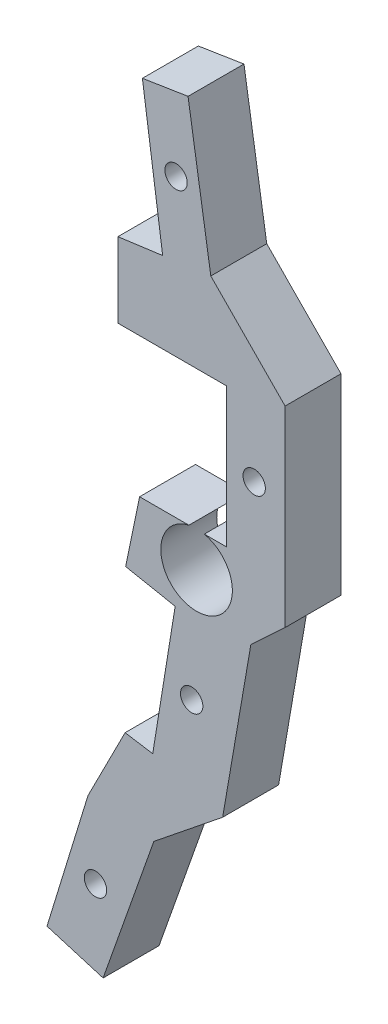
ISO-10303-21;
HEADER;
FILE_DESCRIPTION(('STEP AP214'),'2;1');
FILE_NAME('part.step','',(''),(''),'','','');
FILE_SCHEMA(('AUTOMOTIVE_DESIGN { 1 0 10303 214 1 1 1 1 }'));
ENDSEC;
DATA;
#1=APPLICATION_CONTEXT('core data for automotive mechanical design processes');
#2=APPLICATION_PROTOCOL_DEFINITION('international standard','automotive_design',2000,#1);
#3=PRODUCT_CONTEXT('',#1,'mechanical');
#4=PRODUCT('Part','Part','',(#3));
#5=PRODUCT_RELATED_PRODUCT_CATEGORY('part','',(#4));
#6=PRODUCT_DEFINITION_FORMATION('','',#4);
#7=PRODUCT_DEFINITION_CONTEXT('part definition',#1,'design');
#8=PRODUCT_DEFINITION('design','',#6,#7);
#9=PRODUCT_DEFINITION_SHAPE('','',#8);
#10=(LENGTH_UNIT() NAMED_UNIT(*) SI_UNIT(.MILLI.,.METRE.));
#11=(NAMED_UNIT(*) PLANE_ANGLE_UNIT() SI_UNIT($,.RADIAN.));
#12=(NAMED_UNIT(*) SI_UNIT($,.STERADIAN.) SOLID_ANGLE_UNIT());
#13=UNCERTAINTY_MEASURE_WITH_UNIT(LENGTH_MEASURE(1.E-05),#10,'distance_accuracy_value','');
#14=(GEOMETRIC_REPRESENTATION_CONTEXT(3) GLOBAL_UNCERTAINTY_ASSIGNED_CONTEXT((#13)) GLOBAL_UNIT_ASSIGNED_CONTEXT((#10,
#11,#12)) REPRESENTATION_CONTEXT('',''));
#15=CARTESIAN_POINT('',(0.,0.,0.));
#16=DIRECTION('',(0.,0.,1.));
#17=DIRECTION('',(1.,0.,0.));
#18=AXIS2_PLACEMENT_3D('',#15,#16,#17);
#19=CARTESIAN_POINT('',(-30.5965870714115,-3.1687433265874,5.));
#20=DIRECTION('',(0.,-1.,0.));
#21=DIRECTION('',(1.,0.,0.));
#22=AXIS2_PLACEMENT_3D('',#19,#20,#21);
#23=PLANE('',#22);
#24=DIRECTION('',(-1.,0.,0.));
#25=VECTOR('',#24,1.);
#26=CARTESIAN_POINT('',(-30.5965870714115,-3.1687433265874,5.));
#27=LINE('',#26,#25);
#28=CARTESIAN_POINT('',(-26.1903494869509,-3.1687433265874,5.));
#29=VERTEX_POINT('',#28);
#30=CARTESIAN_POINT('',(-30.5965870714115,-3.1687433265874,5.));
#31=VERTEX_POINT('',#30);
#32=EDGE_CURVE('E338',#29,#31,#27,.T.);
#33=ORIENTED_EDGE('',*,*,#32,.F.);
#34=DIRECTION('',(0.,0.,-1.));
#35=VECTOR('',#34,1.);
#36=CARTESIAN_POINT('',(-26.1903494869509,-3.1687433265874,5.));
#37=LINE('',#36,#35);
#38=CARTESIAN_POINT('',(-26.1903494869509,-3.1687433265874,0.));
#39=VERTEX_POINT('',#38);
#40=EDGE_CURVE('E11',#29,#39,#37,.T.);
#41=ORIENTED_EDGE('',*,*,#40,.T.);
#42=DIRECTION('',(-1.,0.,0.));
#43=VECTOR('',#42,1.);
#44=CARTESIAN_POINT('',(-30.5965870714115,-3.1687433265874,0.));
#45=LINE('',#44,#43);
#46=CARTESIAN_POINT('',(-30.5965870714115,-3.1687433265874,0.));
#47=VERTEX_POINT('',#46);
#48=EDGE_CURVE('E243',#39,#47,#45,.T.);
#49=ORIENTED_EDGE('',*,*,#48,.T.);
#50=DIRECTION('',(0.,0.,-1.));
#51=VECTOR('',#50,1.);
#52=CARTESIAN_POINT('',(-30.5965870714115,-3.1687433265874,5.));
#53=LINE('',#52,#51);
#54=EDGE_CURVE('E302',#31,#47,#53,.T.);
#55=ORIENTED_EDGE('',*,*,#54,.F.);
#56=EDGE_LOOP('',(#33,#41,#49,#55));
#57=FACE_BOUND('',#56,.T.);
#58=ADVANCED_FACE('F39',(#57),#23,.F.);
#59=CARTESIAN_POINT('',(0.,0.,5.));
#60=DIRECTION('',(0.,0.,1.));
#61=DIRECTION('',(1.,0.,0.));
#62=AXIS2_PLACEMENT_3D('',#59,#60,#61);
#63=PLANE('',#62);
#64=CARTESIAN_POINT('',(-25.5,-6.29339012036532,5.));
#65=DIRECTION('',(0.,0.,-1.));
#66=DIRECTION('',(-1.,0.,0.));
#67=AXIS2_PLACEMENT_3D('',#64,#65,#66);
#68=CIRCLE('',#67,3.2);
#69=CARTESIAN_POINT('',(-24.8096505130491,-3.1687433265874,5.));
#70=VERTEX_POINT('',#69);
#71=EDGE_CURVE('E54',#70,#29,#68,.T.);
#72=ORIENTED_EDGE('',*,*,#71,.T.);
#73=ORIENTED_EDGE('',*,*,#32,.T.);
#74=DIRECTION('',(-0.202921065738763,-0.979195098578136,0.));
#75=VECTOR('',#74,1.);
#76=CARTESIAN_POINT('',(-31.8460070791283,-9.19781646972155,5.));
#77=LINE('',#76,#75);
#78=CARTESIAN_POINT('',(-31.8460070791283,-9.19781646972155,5.));
#79=VERTEX_POINT('',#78);
#80=EDGE_CURVE('E337',#31,#79,#77,.T.);
#81=ORIENTED_EDGE('',*,*,#80,.T.);
#82=DIRECTION('',(0.981466290382322,-0.191634863329104,0.));
#83=VECTOR('',#82,1.);
#84=CARTESIAN_POINT('',(-27.4169379393573,-10.0626083302189,5.));
#85=LINE('',#84,#83);
#86=CARTESIAN_POINT('',(-27.4169379393573,-10.0626083302189,5.));
#87=VERTEX_POINT('',#86);
#88=EDGE_CURVE('E340',#79,#87,#85,.T.);
#89=ORIENTED_EDGE('',*,*,#88,.T.);
#90=DIRECTION('',(-0.159430880218422,-0.987209093572774,0.));
#91=VECTOR('',#90,1.);
#92=CARTESIAN_POINT('',(-29.4224525021614,-22.4809190801843,5.));
#93=LINE('',#92,#91);
#94=CARTESIAN_POINT('',(-29.4224525021614,-22.4809190801843,5.));
#95=VERTEX_POINT('',#94);
#96=EDGE_CURVE('E346',#87,#95,#93,.T.);
#97=ORIENTED_EDGE('',*,*,#96,.T.);
#98=DIRECTION('',(-0.987209093572775,0.159430880218422,0.));
#99=VECTOR('',#98,1.);
#100=CARTESIAN_POINT('',(-31.8904752360934,-22.0823418796382,5.));
#101=LINE('',#100,#99);
#102=CARTESIAN_POINT('',(-31.8904752360934,-22.0823418796382,5.));
#103=VERTEX_POINT('',#102);
#104=EDGE_CURVE('E348',#95,#103,#101,.T.);
#105=ORIENTED_EDGE('',*,*,#104,.T.);
#106=DIRECTION('',(-0.453222380022539,-0.891397483868282,0.));
#107=VECTOR('',#106,1.);
#108=CARTESIAN_POINT('',(-35.2108263380757,-28.6128062792983,5.));
#109=LINE('',#108,#107);
#110=CARTESIAN_POINT('',(-35.2108263380757,-28.6128062792983,5.));
#111=VERTEX_POINT('',#110);
#112=EDGE_CURVE('E350',#103,#111,#109,.T.);
#113=ORIENTED_EDGE('',*,*,#112,.T.);
#114=DIRECTION('',(-0.293288715112897,-0.956023916849064,0.));
#115=VECTOR('',#114,1.);
#116=CARTESIAN_POINT('',(-38.8751607484344,-40.5573208655052,5.));
#117=LINE('',#116,#115);
#118=CARTESIAN_POINT('',(-38.8751607484344,-40.5573208655052,5.));
#119=VERTEX_POINT('',#118);
#120=EDGE_CURVE('E352',#111,#119,#117,.T.);
#121=ORIENTED_EDGE('',*,*,#120,.T.);
#122=DIRECTION('',(0.9578672843626,-0.287211186320828,0.));
#123=VECTOR('',#122,1.);
#124=CARTESIAN_POINT('',(-33.8582968146645,-42.061599658143,5.));
#125=LINE('',#124,#123);
#126=CARTESIAN_POINT('',(-33.8582968146645,-42.061599658143,5.));
#127=VERTEX_POINT('',#126);
#128=EDGE_CURVE('E354',#119,#127,#125,.T.);
#129=ORIENTED_EDGE('',*,*,#128,.T.);
#130=DIRECTION('',(0.332988929991046,0.942930735793154,0.));
#131=VECTOR('',#130,1.);
#132=CARTESIAN_POINT('',(-29.3228048042204,-29.2183654439996,5.));
#133=LINE('',#132,#131);
#134=CARTESIAN_POINT('',(-29.3228048042204,-29.2183654439996,5.));
#135=VERTEX_POINT('',#134);
#136=EDGE_CURVE('E356',#127,#135,#133,.T.);
#137=ORIENTED_EDGE('',*,*,#136,.T.);
#138=DIRECTION('',(0.779375670806284,0.62655691182466,0.));
#139=VECTOR('',#138,1.);
#140=CARTESIAN_POINT('',(-23.1691684609461,-24.2713244621515,5.));
#141=LINE('',#140,#139);
#142=CARTESIAN_POINT('',(-23.1691684609461,-24.2713244621515,5.));
#143=VERTEX_POINT('',#142);
#144=EDGE_CURVE('E358',#135,#143,#141,.T.);
#145=ORIENTED_EDGE('',*,*,#144,.T.);
#146=DIRECTION('',(0.169707796397413,0.985494426083646,0.));
#147=VECTOR('',#146,1.);
#148=CARTESIAN_POINT('',(-20.6482030607888,-9.63205977930274,5.));
#149=LINE('',#148,#147);
#150=CARTESIAN_POINT('',(-20.6482030607888,-9.63205977930274,5.));
#151=VERTEX_POINT('',#150);
#152=EDGE_CURVE('E206',#143,#151,#149,.T.);
#153=ORIENTED_EDGE('',*,*,#152,.T.);
#154=DIRECTION('',(0.733302677846267,0.679902333179916,0.));
#155=VECTOR('',#154,1.);
#156=CARTESIAN_POINT('',(-17.5893957274331,-6.79599998363354,5.));
#157=LINE('',#156,#155);
#158=CARTESIAN_POINT('',(-17.5893957274331,-6.79599998363354,5.));
#159=VERTEX_POINT('',#158);
#160=EDGE_CURVE('E198',#151,#159,#157,.T.);
#161=ORIENTED_EDGE('',*,*,#160,.T.);
#162=DIRECTION('',(0.,1.,0.));
#163=VECTOR('',#162,1.);
#164=CARTESIAN_POINT('',(-17.5893957274331,10.3556624327027,5.));
#165=LINE('',#164,#163);
#166=CARTESIAN_POINT('',(-17.5893957274331,10.3556624327027,5.));
#167=VERTEX_POINT('',#166);
#168=EDGE_CURVE('E203',#159,#167,#165,.T.);
#169=ORIENTED_EDGE('',*,*,#168,.T.);
#170=DIRECTION('',(-0.701291160435926,0.712874959789186,0.));
#171=VECTOR('',#170,1.);
#172=CARTESIAN_POINT('',(-24.2298538551576,17.1058064354316,5.));
#173=LINE('',#172,#171);
#174=CARTESIAN_POINT('',(-24.2298538551576,17.1058064354316,5.));
#175=VERTEX_POINT('',#174);
#176=EDGE_CURVE('E63',#167,#175,#173,.T.);
#177=ORIENTED_EDGE('',*,*,#176,.T.);
#178=DIRECTION('',(-0.155902250885887,0.987772488060239,0.));
#179=VECTOR('',#178,1.);
#180=CARTESIAN_POINT('',(-26.2648110095433,29.9989794336513,5.));
#181=LINE('',#180,#179);
#182=CARTESIAN_POINT('',(-26.2648110095433,29.9989794336513,5.));
#183=VERTEX_POINT('',#182);
#184=EDGE_CURVE('E271',#175,#183,#181,.T.);
#185=ORIENTED_EDGE('',*,*,#184,.T.);
#186=DIRECTION('',(-0.987772488060238,-0.15590225088589,0.));
#187=VECTOR('',#186,1.);
#188=CARTESIAN_POINT('',(-30.3449784951655,29.3549978461007,5.));
#189=LINE('',#188,#187);
#190=CARTESIAN_POINT('',(-30.3449784951655,29.3549978461007,5.));
#191=VERTEX_POINT('',#190);
#192=EDGE_CURVE('E144',#183,#191,#189,.T.);
#193=ORIENTED_EDGE('',*,*,#192,.T.);
#194=DIRECTION('',(0.139939364505248,-0.990160075069616,0.));
#195=VECTOR('',#194,1.);
#196=CARTESIAN_POINT('',(-28.5334813579348,16.5375025849909,5.));
#197=LINE('',#196,#195);
#198=CARTESIAN_POINT('',(-28.5334813579348,16.5375025849909,5.));
#199=VERTEX_POINT('',#198);
#200=EDGE_CURVE('E379',#191,#199,#197,.T.);
#201=ORIENTED_EDGE('',*,*,#200,.T.);
#202=DIRECTION('',(-0.991040464580936,-0.133561961513009,0.));
#203=VECTOR('',#202,1.);
#204=CARTESIAN_POINT('',(-32.5342653655656,15.9983191926407,5.));
#205=LINE('',#204,#203);
#206=CARTESIAN_POINT('',(-32.5342653655656,15.9983191926407,5.));
#207=VERTEX_POINT('',#206);
#208=EDGE_CURVE('E386',#199,#207,#205,.T.);
#209=ORIENTED_EDGE('',*,*,#208,.T.);
#210=DIRECTION('',(0.,-1.,0.));
#211=VECTOR('',#210,1.);
#212=CARTESIAN_POINT('',(-32.5342653655656,9.30000000000038,5.));
#213=LINE('',#212,#211);
#214=CARTESIAN_POINT('',(-32.5342653655656,9.30000000000038,5.));
#215=VERTEX_POINT('',#214);
#216=EDGE_CURVE('E388',#207,#215,#213,.T.);
#217=ORIENTED_EDGE('',*,*,#216,.T.);
#218=DIRECTION('',(1.,0.,0.));
#219=VECTOR('',#218,1.);
#220=CARTESIAN_POINT('',(-22.8460239920954,9.30000000000038,5.));
#221=LINE('',#220,#219);
#222=CARTESIAN_POINT('',(-22.8460239920954,9.30000000000038,5.));
#223=VERTEX_POINT('',#222);
#224=EDGE_CURVE('E389',#215,#223,#221,.T.);
#225=ORIENTED_EDGE('',*,*,#224,.T.);
#226=DIRECTION('',(0.,-1.,0.));
#227=VECTOR('',#226,1.);
#228=CARTESIAN_POINT('',(-22.8460239920954,-3.1687433265874,5.));
#229=LINE('',#228,#227);
#230=CARTESIAN_POINT('',(-22.8460239920954,-3.1687433265874,5.));
#231=VERTEX_POINT('',#230);
#232=EDGE_CURVE('E335',#223,#231,#229,.T.);
#233=ORIENTED_EDGE('',*,*,#232,.T.);
#234=EDGE_CURVE('E328',#231,#70,#27,.T.);
#235=ORIENTED_EDGE('',*,*,#234,.T.);
#236=EDGE_LOOP('',(#72,#73,#81,#89,#97,#105,#113,#121,#129,#137,#145,#153,#161,#169,#177,#185,
#193,#201,#209,#217,#225,#233,#235));
#237=FACE_BOUND('',#236,.T.);
#238=CARTESIAN_POINT('',(-25.9415840574781,-16.5673362044724,5.));
#239=DIRECTION('',(0.,0.,1.));
#240=DIRECTION('',(1.,0.,0.));
#241=AXIS2_PLACEMENT_3D('',#238,#239,#240);
#242=CIRCLE('',#241,1.);
#243=CARTESIAN_POINT('',(-24.9415840574781,-16.5673362044724,5.));
#244=VERTEX_POINT('',#243);
#245=EDGE_CURVE('E413',#244,#244,#242,.T.);
#246=ORIENTED_EDGE('',*,*,#245,.F.);
#247=EDGE_LOOP('',(#246));
#248=FACE_BOUND('',#247,.T.);
#249=CARTESIAN_POINT('',(-27.3350830257802,23.2553532383366,5.));
#250=DIRECTION('',(0.,0.,1.));
#251=DIRECTION('',(1.,0.,0.));
#252=AXIS2_PLACEMENT_3D('',#249,#250,#251);
#253=CIRCLE('',#252,1.);
#254=CARTESIAN_POINT('',(-26.3350830257802,23.2553532383366,5.));
#255=VERTEX_POINT('',#254);
#256=EDGE_CURVE('E231',#255,#255,#253,.T.);
#257=ORIENTED_EDGE('',*,*,#256,.F.);
#258=EDGE_LOOP('',(#257));
#259=FACE_BOUND('',#258,.T.);
#260=CARTESIAN_POINT('',(-20.35,3.1,5.));
#261=DIRECTION('',(0.,0.,1.));
#262=DIRECTION('',(1.,0.,0.));
#263=AXIS2_PLACEMENT_3D('',#260,#261,#262);
#264=CIRCLE('',#263,1.);
#265=CARTESIAN_POINT('',(-19.35,3.1,5.));
#266=VERTEX_POINT('',#265);
#267=EDGE_CURVE('E419',#266,#266,#264,.T.);
#268=ORIENTED_EDGE('',*,*,#267,.F.);
#269=EDGE_LOOP('',(#268));
#270=FACE_BOUND('',#269,.T.);
#271=CARTESIAN_POINT('',(-34.54097565442,-35.1178184034353,5.));
#272=DIRECTION('',(0.,0.,1.));
#273=DIRECTION('',(1.,0.,0.));
#274=AXIS2_PLACEMENT_3D('',#271,#272,#273);
#275=CIRCLE('',#274,0.999999999999998);
#276=CARTESIAN_POINT('',(-33.54097565442,-35.1178184034353,5.));
#277=VERTEX_POINT('',#276);
#278=EDGE_CURVE('E407',#277,#277,#275,.T.);
#279=ORIENTED_EDGE('',*,*,#278,.F.);
#280=EDGE_LOOP('',(#279));
#281=FACE_BOUND('',#280,.T.);
#282=ADVANCED_FACE('F200',(#237,#248,#259,#270,#281),#63,.T.);
#283=CARTESIAN_POINT('',(0.,0.,0.));
#284=DIRECTION('',(0.,0.,1.));
#285=DIRECTION('',(1.,0.,0.));
#286=AXIS2_PLACEMENT_3D('',#283,#284,#285);
#287=PLANE('',#286);
#288=ORIENTED_EDGE('',*,*,#48,.F.);
#289=CARTESIAN_POINT('',(-25.5,-6.29339012036532,0.));
#290=DIRECTION('',(0.,0.,-1.));
#291=DIRECTION('',(-1.,0.,0.));
#292=AXIS2_PLACEMENT_3D('',#289,#290,#291);
#293=CIRCLE('',#292,3.2);
#294=CARTESIAN_POINT('',(-24.8096505130491,-3.1687433265874,0.));
#295=VERTEX_POINT('',#294);
#296=EDGE_CURVE('E400',#295,#39,#293,.T.);
#297=ORIENTED_EDGE('',*,*,#296,.F.);
#298=CARTESIAN_POINT('',(-22.8460239920954,-3.1687433265874,0.));
#299=VERTEX_POINT('',#298);
#300=EDGE_CURVE('E244',#299,#295,#45,.T.);
#301=ORIENTED_EDGE('',*,*,#300,.F.);
#302=DIRECTION('',(0.,-1.,0.));
#303=VECTOR('',#302,1.);
#304=CARTESIAN_POINT('',(-22.8460239920954,-3.1687433265874,0.));
#305=LINE('',#304,#303);
#306=CARTESIAN_POINT('',(-22.8460239920954,9.30000000000038,0.));
#307=VERTEX_POINT('',#306);
#308=EDGE_CURVE('E241',#307,#299,#305,.T.);
#309=ORIENTED_EDGE('',*,*,#308,.F.);
#310=DIRECTION('',(1.,0.,0.));
#311=VECTOR('',#310,1.);
#312=CARTESIAN_POINT('',(-22.8460239920954,9.30000000000038,0.));
#313=LINE('',#312,#311);
#314=CARTESIAN_POINT('',(-32.5342653655656,9.30000000000038,0.));
#315=VERTEX_POINT('',#314);
#316=EDGE_CURVE('E239',#315,#307,#313,.T.);
#317=ORIENTED_EDGE('',*,*,#316,.F.);
#318=DIRECTION('',(0.,-1.,0.));
#319=VECTOR('',#318,1.);
#320=CARTESIAN_POINT('',(-32.5342653655656,9.30000000000038,0.));
#321=LINE('',#320,#319);
#322=CARTESIAN_POINT('',(-32.5342653655656,15.9983191926407,0.));
#323=VERTEX_POINT('',#322);
#324=EDGE_CURVE('E237',#323,#315,#321,.T.);
#325=ORIENTED_EDGE('',*,*,#324,.F.);
#326=DIRECTION('',(-0.991040464580936,-0.133561961513009,0.));
#327=VECTOR('',#326,1.);
#328=CARTESIAN_POINT('',(-32.5342653655656,15.9983191926407,0.));
#329=LINE('',#328,#327);
#330=CARTESIAN_POINT('',(-28.5334813579348,16.5375025849909,0.));
#331=VERTEX_POINT('',#330);
#332=EDGE_CURVE('E235',#331,#323,#329,.T.);
#333=ORIENTED_EDGE('',*,*,#332,.F.);
#334=DIRECTION('',(0.139939364505248,-0.990160075069616,0.));
#335=VECTOR('',#334,1.);
#336=CARTESIAN_POINT('',(-28.5334813579348,16.5375025849909,0.));
#337=LINE('',#336,#335);
#338=CARTESIAN_POINT('',(-30.3449784951655,29.3549978461007,0.));
#339=VERTEX_POINT('',#338);
#340=EDGE_CURVE('E233',#339,#331,#337,.T.);
#341=ORIENTED_EDGE('',*,*,#340,.F.);
#342=DIRECTION('',(-0.987772488060238,-0.15590225088589,0.));
#343=VECTOR('',#342,1.);
#344=CARTESIAN_POINT('',(-30.3449784951655,29.3549978461007,0.));
#345=LINE('',#344,#343);
#346=CARTESIAN_POINT('',(-26.2648110095433,29.9989794336513,0.));
#347=VERTEX_POINT('',#346);
#348=EDGE_CURVE('E230',#347,#339,#345,.T.);
#349=ORIENTED_EDGE('',*,*,#348,.F.);
#350=DIRECTION('',(-0.155902250885887,0.987772488060239,0.));
#351=VECTOR('',#350,1.);
#352=CARTESIAN_POINT('',(-26.2648110095433,29.9989794336513,0.));
#353=LINE('',#352,#351);
#354=CARTESIAN_POINT('',(-24.2298538551576,17.1058064354316,0.));
#355=VERTEX_POINT('',#354);
#356=EDGE_CURVE('E227',#355,#347,#353,.T.);
#357=ORIENTED_EDGE('',*,*,#356,.F.);
#358=DIRECTION('',(-0.701291160435926,0.712874959789186,0.));
#359=VECTOR('',#358,1.);
#360=CARTESIAN_POINT('',(-24.2298538551576,17.1058064354316,0.));
#361=LINE('',#360,#359);
#362=CARTESIAN_POINT('',(-17.5893957274331,10.3556624327027,0.));
#363=VERTEX_POINT('',#362);
#364=EDGE_CURVE('E135',#363,#355,#361,.T.);
#365=ORIENTED_EDGE('',*,*,#364,.F.);
#366=DIRECTION('',(0.,1.,0.));
#367=VECTOR('',#366,1.);
#368=CARTESIAN_POINT('',(-17.5893957274331,10.3556624327027,0.));
#369=LINE('',#368,#367);
#370=CARTESIAN_POINT('',(-17.5893957274331,-6.79599998363354,0.));
#371=VERTEX_POINT('',#370);
#372=EDGE_CURVE('E268',#371,#363,#369,.T.);
#373=ORIENTED_EDGE('',*,*,#372,.F.);
#374=DIRECTION('',(0.733302677846267,0.679902333179916,0.));
#375=VECTOR('',#374,1.);
#376=CARTESIAN_POINT('',(-17.5893957274331,-6.79599998363354,0.));
#377=LINE('',#376,#375);
#378=CARTESIAN_POINT('',(-20.6482030607888,-9.63205977930274,0.));
#379=VERTEX_POINT('',#378);
#380=EDGE_CURVE('E215',#379,#371,#377,.T.);
#381=ORIENTED_EDGE('',*,*,#380,.F.);
#382=DIRECTION('',(0.169707796397413,0.985494426083646,0.));
#383=VECTOR('',#382,1.);
#384=CARTESIAN_POINT('',(-20.6482030607888,-9.63205977930274,0.));
#385=LINE('',#384,#383);
#386=CARTESIAN_POINT('',(-23.1691684609461,-24.2713244621515,0.));
#387=VERTEX_POINT('',#386);
#388=EDGE_CURVE('E265',#387,#379,#385,.T.);
#389=ORIENTED_EDGE('',*,*,#388,.F.);
#390=DIRECTION('',(0.779375670806284,0.62655691182466,0.));
#391=VECTOR('',#390,1.);
#392=CARTESIAN_POINT('',(-23.1691684609461,-24.2713244621515,0.));
#393=LINE('',#392,#391);
#394=CARTESIAN_POINT('',(-29.3228048042204,-29.2183654439996,0.));
#395=VERTEX_POINT('',#394);
#396=EDGE_CURVE('E263',#395,#387,#393,.T.);
#397=ORIENTED_EDGE('',*,*,#396,.F.);
#398=DIRECTION('',(0.332988929991046,0.942930735793154,0.));
#399=VECTOR('',#398,1.);
#400=CARTESIAN_POINT('',(-29.3228048042204,-29.2183654439996,0.));
#401=LINE('',#400,#399);
#402=CARTESIAN_POINT('',(-33.8582968146645,-42.061599658143,0.));
#403=VERTEX_POINT('',#402);
#404=EDGE_CURVE('E261',#403,#395,#401,.T.);
#405=ORIENTED_EDGE('',*,*,#404,.F.);
#406=DIRECTION('',(0.9578672843626,-0.287211186320828,0.));
#407=VECTOR('',#406,1.);
#408=CARTESIAN_POINT('',(-33.8582968146645,-42.061599658143,0.));
#409=LINE('',#408,#407);
#410=CARTESIAN_POINT('',(-38.8751607484344,-40.5573208655052,0.));
#411=VERTEX_POINT('',#410);
#412=EDGE_CURVE('E259',#411,#403,#409,.T.);
#413=ORIENTED_EDGE('',*,*,#412,.F.);
#414=DIRECTION('',(-0.293288715112897,-0.956023916849064,0.));
#415=VECTOR('',#414,1.);
#416=CARTESIAN_POINT('',(-38.8751607484344,-40.5573208655052,0.));
#417=LINE('',#416,#415);
#418=CARTESIAN_POINT('',(-35.2108263380757,-28.6128062792983,0.));
#419=VERTEX_POINT('',#418);
#420=EDGE_CURVE('E257',#419,#411,#417,.T.);
#421=ORIENTED_EDGE('',*,*,#420,.F.);
#422=DIRECTION('',(-0.453222380022539,-0.891397483868282,0.));
#423=VECTOR('',#422,1.);
#424=CARTESIAN_POINT('',(-35.2108263380757,-28.6128062792983,0.));
#425=LINE('',#424,#423);
#426=CARTESIAN_POINT('',(-31.8904752360934,-22.0823418796382,0.));
#427=VERTEX_POINT('',#426);
#428=EDGE_CURVE('E255',#427,#419,#425,.T.);
#429=ORIENTED_EDGE('',*,*,#428,.F.);
#430=DIRECTION('',(-0.987209093572775,0.159430880218422,0.));
#431=VECTOR('',#430,1.);
#432=CARTESIAN_POINT('',(-31.8904752360934,-22.0823418796382,0.));
#433=LINE('',#432,#431);
#434=CARTESIAN_POINT('',(-29.4224525021614,-22.4809190801843,0.));
#435=VERTEX_POINT('',#434);
#436=EDGE_CURVE('E253',#435,#427,#433,.T.);
#437=ORIENTED_EDGE('',*,*,#436,.F.);
#438=DIRECTION('',(-0.159430880218422,-0.987209093572774,0.));
#439=VECTOR('',#438,1.);
#440=CARTESIAN_POINT('',(-29.4224525021614,-22.4809190801843,0.));
#441=LINE('',#440,#439);
#442=CARTESIAN_POINT('',(-27.4169379393573,-10.0626083302189,0.));
#443=VERTEX_POINT('',#442);
#444=EDGE_CURVE('E251',#443,#435,#441,.T.);
#445=ORIENTED_EDGE('',*,*,#444,.F.);
#446=DIRECTION('',(0.981466290382322,-0.191634863329104,0.));
#447=VECTOR('',#446,1.);
#448=CARTESIAN_POINT('',(-27.4169379393573,-10.0626083302189,0.));
#449=LINE('',#448,#447);
#450=CARTESIAN_POINT('',(-31.8460070791283,-9.19781646972155,0.));
#451=VERTEX_POINT('',#450);
#452=EDGE_CURVE('E249',#451,#443,#449,.T.);
#453=ORIENTED_EDGE('',*,*,#452,.F.);
#454=DIRECTION('',(-0.202921065738763,-0.979195098578136,0.));
#455=VECTOR('',#454,1.);
#456=CARTESIAN_POINT('',(-31.8460070791283,-9.19781646972155,0.));
#457=LINE('',#456,#455);
#458=EDGE_CURVE('E247',#47,#451,#457,.T.);
#459=ORIENTED_EDGE('',*,*,#458,.F.);
#460=EDGE_LOOP('',(#288,#297,#301,#309,#317,#325,#333,#341,#349,#357,#365,#373,#381,#389,#397,
#405,#413,#421,#429,#437,#445,#453,#459));
#461=FACE_BOUND('',#460,.T.);
#462=CARTESIAN_POINT('',(-27.3350830257802,23.2553532383366,0.));
#463=DIRECTION('',(0.,0.,1.));
#464=DIRECTION('',(1.,0.,0.));
#465=AXIS2_PLACEMENT_3D('',#462,#463,#464);
#466=CIRCLE('',#465,1.);
#467=CARTESIAN_POINT('',(-26.3350830257802,23.2553532383366,0.));
#468=VERTEX_POINT('',#467);
#469=EDGE_CURVE('E382',#468,#468,#466,.T.);
#470=ORIENTED_EDGE('',*,*,#469,.T.);
#471=EDGE_LOOP('',(#470));
#472=FACE_BOUND('',#471,.T.);
#473=CARTESIAN_POINT('',(-20.35,3.1,0.));
#474=DIRECTION('',(0.,0.,1.));
#475=DIRECTION('',(1.,0.,0.));
#476=AXIS2_PLACEMENT_3D('',#473,#474,#475);
#477=CIRCLE('',#476,1.);
#478=CARTESIAN_POINT('',(-19.35,3.1,0.));
#479=VERTEX_POINT('',#478);
#480=EDGE_CURVE('E416',#479,#479,#477,.T.);
#481=ORIENTED_EDGE('',*,*,#480,.T.);
#482=EDGE_LOOP('',(#481));
#483=FACE_BOUND('',#482,.T.);
#484=CARTESIAN_POINT('',(-25.9415840574781,-16.5673362044724,0.));
#485=DIRECTION('',(0.,0.,1.));
#486=DIRECTION('',(1.,0.,0.));
#487=AXIS2_PLACEMENT_3D('',#484,#485,#486);
#488=CIRCLE('',#487,1.);
#489=CARTESIAN_POINT('',(-24.9415840574781,-16.5673362044724,0.));
#490=VERTEX_POINT('',#489);
#491=EDGE_CURVE('E410',#490,#490,#488,.T.);
#492=ORIENTED_EDGE('',*,*,#491,.T.);
#493=EDGE_LOOP('',(#492));
#494=FACE_BOUND('',#493,.T.);
#495=CARTESIAN_POINT('',(-34.54097565442,-35.1178184034353,0.));
#496=DIRECTION('',(0.,0.,1.));
#497=DIRECTION('',(1.,0.,0.));
#498=AXIS2_PLACEMENT_3D('',#495,#496,#497);
#499=CIRCLE('',#498,0.999999999999998);
#500=CARTESIAN_POINT('',(-33.54097565442,-35.1178184034353,0.));
#501=VERTEX_POINT('',#500);
#502=EDGE_CURVE('E404',#501,#501,#499,.T.);
#503=ORIENTED_EDGE('',*,*,#502,.T.);
#504=EDGE_LOOP('',(#503));
#505=FACE_BOUND('',#504,.T.);
#506=ADVANCED_FACE('F371',(#461,#472,#483,#494,#505),#287,.F.);
#507=CARTESIAN_POINT('',(-26.2648110095433,29.9989794336513,5.));
#508=DIRECTION('',(-0.987772488060239,-0.155902250885887,0.));
#509=DIRECTION('',(0.155902250885887,-0.987772488060239,0.));
#510=AXIS2_PLACEMENT_3D('',#507,#508,#509);
#511=PLANE('',#510);
#512=ORIENTED_EDGE('',*,*,#356,.T.);
#513=DIRECTION('',(0.,0.,-1.));
#514=VECTOR('',#513,1.);
#515=CARTESIAN_POINT('',(-26.2648110095433,29.9989794336513,5.));
#516=LINE('',#515,#514);
#517=EDGE_CURVE('E323',#183,#347,#516,.T.);
#518=ORIENTED_EDGE('',*,*,#517,.F.);
#519=ORIENTED_EDGE('',*,*,#184,.F.);
#520=DIRECTION('',(0.,0.,-1.));
#521=VECTOR('',#520,1.);
#522=CARTESIAN_POINT('',(-24.2298538551576,17.1058064354316,5.));
#523=LINE('',#522,#521);
#524=EDGE_CURVE('E223',#175,#355,#523,.T.);
#525=ORIENTED_EDGE('',*,*,#524,.T.);
#526=EDGE_LOOP('',(#512,#518,#519,#525));
#527=FACE_BOUND('',#526,.T.);
#528=ADVANCED_FACE('F41',(#527),#511,.F.);
#529=CARTESIAN_POINT('',(-30.3449784951655,29.3549978461007,5.));
#530=DIRECTION('',(0.15590225088589,-0.987772488060238,0.));
#531=DIRECTION('',(0.987772488060238,0.15590225088589,0.));
#532=AXIS2_PLACEMENT_3D('',#529,#530,#531);
#533=PLANE('',#532);
#534=ORIENTED_EDGE('',*,*,#348,.T.);
#535=DIRECTION('',(0.,0.,-1.));
#536=VECTOR('',#535,1.);
#537=CARTESIAN_POINT('',(-30.3449784951655,29.3549978461007,5.));
#538=LINE('',#537,#536);
#539=EDGE_CURVE('E320',#191,#339,#538,.T.);
#540=ORIENTED_EDGE('',*,*,#539,.F.);
#541=ORIENTED_EDGE('',*,*,#192,.F.);
#542=ORIENTED_EDGE('',*,*,#517,.T.);
#543=EDGE_LOOP('',(#534,#540,#541,#542));
#544=FACE_BOUND('',#543,.T.);
#545=ADVANCED_FACE('F477',(#544),#533,.F.);
#546=CARTESIAN_POINT('',(-28.5334813579348,16.5375025849909,5.));
#547=DIRECTION('',(0.990160075069616,0.139939364505248,0.));
#548=DIRECTION('',(-0.139939364505248,0.990160075069616,0.));
#549=AXIS2_PLACEMENT_3D('',#546,#547,#548);
#550=PLANE('',#549);
#551=ORIENTED_EDGE('',*,*,#340,.T.);
#552=DIRECTION('',(0.,0.,-1.));
#553=VECTOR('',#552,1.);
#554=CARTESIAN_POINT('',(-28.5334813579348,16.5375025849909,5.));
#555=LINE('',#554,#553);
#556=EDGE_CURVE('E317',#199,#331,#555,.T.);
#557=ORIENTED_EDGE('',*,*,#556,.F.);
#558=ORIENTED_EDGE('',*,*,#200,.F.);
#559=ORIENTED_EDGE('',*,*,#539,.T.);
#560=EDGE_LOOP('',(#551,#557,#558,#559));
#561=FACE_BOUND('',#560,.T.);
#562=ADVANCED_FACE('F474',(#561),#550,.F.);
#563=CARTESIAN_POINT('',(-32.5342653655656,15.9983191926407,5.));
#564=DIRECTION('',(0.133561961513009,-0.991040464580936,0.));
#565=DIRECTION('',(0.991040464580936,0.133561961513009,0.));
#566=AXIS2_PLACEMENT_3D('',#563,#564,#565);
#567=PLANE('',#566);
#568=ORIENTED_EDGE('',*,*,#332,.T.);
#569=DIRECTION('',(0.,0.,-1.));
#570=VECTOR('',#569,1.);
#571=CARTESIAN_POINT('',(-32.5342653655656,15.9983191926407,5.));
#572=LINE('',#571,#570);
#573=EDGE_CURVE('E314',#207,#323,#572,.T.);
#574=ORIENTED_EDGE('',*,*,#573,.F.);
#575=ORIENTED_EDGE('',*,*,#208,.F.);
#576=ORIENTED_EDGE('',*,*,#556,.T.);
#577=EDGE_LOOP('',(#568,#574,#575,#576));
#578=FACE_BOUND('',#577,.T.);
#579=ADVANCED_FACE('F470',(#578),#567,.F.);
#580=CARTESIAN_POINT('',(-32.5342653655656,9.30000000000038,5.));
#581=DIRECTION('',(1.,0.,0.));
#582=DIRECTION('',(0.,0.,-1.));
#583=AXIS2_PLACEMENT_3D('',#580,#581,#582);
#584=PLANE('',#583);
#585=ORIENTED_EDGE('',*,*,#324,.T.);
#586=DIRECTION('',(0.,0.,-1.));
#587=VECTOR('',#586,1.);
#588=CARTESIAN_POINT('',(-32.5342653655656,9.30000000000038,5.));
#589=LINE('',#588,#587);
#590=EDGE_CURVE('E311',#215,#315,#589,.T.);
#591=ORIENTED_EDGE('',*,*,#590,.F.);
#592=ORIENTED_EDGE('',*,*,#216,.F.);
#593=ORIENTED_EDGE('',*,*,#573,.T.);
#594=EDGE_LOOP('',(#585,#591,#592,#593));
#595=FACE_BOUND('',#594,.T.);
#596=ADVANCED_FACE('F465',(#595),#584,.F.);
#597=CARTESIAN_POINT('',(-22.8460239920954,9.30000000000038,5.));
#598=DIRECTION('',(0.,1.,0.));
#599=DIRECTION('',(0.,0.,1.));
#600=AXIS2_PLACEMENT_3D('',#597,#598,#599);
#601=PLANE('',#600);
#602=ORIENTED_EDGE('',*,*,#316,.T.);
#603=DIRECTION('',(0.,0.,-1.));
#604=VECTOR('',#603,1.);
#605=CARTESIAN_POINT('',(-22.8460239920954,9.30000000000038,5.));
#606=LINE('',#605,#604);
#607=EDGE_CURVE('E308',#223,#307,#606,.T.);
#608=ORIENTED_EDGE('',*,*,#607,.F.);
#609=ORIENTED_EDGE('',*,*,#224,.F.);
#610=ORIENTED_EDGE('',*,*,#590,.T.);
#611=EDGE_LOOP('',(#602,#608,#609,#610));
#612=FACE_BOUND('',#611,.T.);
#613=ADVANCED_FACE('F395',(#612),#601,.F.);
#614=CARTESIAN_POINT('',(-22.8460239920954,-3.1687433265874,5.));
#615=DIRECTION('',(1.,0.,0.));
#616=DIRECTION('',(0.,0.,-1.));
#617=AXIS2_PLACEMENT_3D('',#614,#615,#616);
#618=PLANE('',#617);
#619=ORIENTED_EDGE('',*,*,#308,.T.);
#620=DIRECTION('',(0.,0.,-1.));
#621=VECTOR('',#620,1.);
#622=CARTESIAN_POINT('',(-22.8460239920954,-3.1687433265874,5.));
#623=LINE('',#622,#621);
#624=EDGE_CURVE('E305',#231,#299,#623,.T.);
#625=ORIENTED_EDGE('',*,*,#624,.F.);
#626=ORIENTED_EDGE('',*,*,#232,.F.);
#627=ORIENTED_EDGE('',*,*,#607,.T.);
#628=EDGE_LOOP('',(#619,#625,#626,#627));
#629=FACE_BOUND('',#628,.T.);
#630=ADVANCED_FACE('F399',(#629),#618,.F.);
#631=ORIENTED_EDGE('',*,*,#300,.T.);
#632=DIRECTION('',(0.,0.,-1.));
#633=VECTOR('',#632,1.);
#634=CARTESIAN_POINT('',(-24.8096505130491,-3.1687433265874,5.));
#635=LINE('',#634,#633);
#636=EDGE_CURVE('E47',#295,#70,#635,.F.);
#637=ORIENTED_EDGE('',*,*,#636,.T.);
#638=ORIENTED_EDGE('',*,*,#234,.F.);
#639=ORIENTED_EDGE('',*,*,#624,.T.);
#640=EDGE_LOOP('',(#631,#637,#638,#639));
#641=FACE_BOUND('',#640,.T.);
#642=ADVANCED_FACE('F327',(#641),#23,.F.);
#643=CARTESIAN_POINT('',(-31.8460070791283,-9.19781646972155,5.));
#644=DIRECTION('',(0.979195098578136,-0.202921065738763,0.));
#645=DIRECTION('',(0.202921065738763,0.979195098578136,0.));
#646=AXIS2_PLACEMENT_3D('',#643,#644,#645);
#647=PLANE('',#646);
#648=ORIENTED_EDGE('',*,*,#458,.T.);
#649=DIRECTION('',(0.,0.,-1.));
#650=VECTOR('',#649,1.);
#651=CARTESIAN_POINT('',(-31.8460070791283,-9.19781646972155,5.));
#652=LINE('',#651,#650);
#653=EDGE_CURVE('E299',#79,#451,#652,.T.);
#654=ORIENTED_EDGE('',*,*,#653,.F.);
#655=ORIENTED_EDGE('',*,*,#80,.F.);
#656=ORIENTED_EDGE('',*,*,#54,.T.);
#657=EDGE_LOOP('',(#648,#654,#655,#656));
#658=FACE_BOUND('',#657,.T.);
#659=ADVANCED_FACE('F453',(#658),#647,.F.);
#660=CARTESIAN_POINT('',(-27.4169379393573,-10.0626083302189,5.));
#661=DIRECTION('',(0.191634863329104,0.981466290382322,0.));
#662=DIRECTION('',(-0.981466290382322,0.191634863329104,0.));
#663=AXIS2_PLACEMENT_3D('',#660,#661,#662);
#664=PLANE('',#663);
#665=ORIENTED_EDGE('',*,*,#452,.T.);
#666=DIRECTION('',(0.,0.,-1.));
#667=VECTOR('',#666,1.);
#668=CARTESIAN_POINT('',(-27.4169379393573,-10.0626083302189,5.));
#669=LINE('',#668,#667);
#670=EDGE_CURVE('E296',#87,#443,#669,.T.);
#671=ORIENTED_EDGE('',*,*,#670,.F.);
#672=ORIENTED_EDGE('',*,*,#88,.F.);
#673=ORIENTED_EDGE('',*,*,#653,.T.);
#674=EDGE_LOOP('',(#665,#671,#672,#673));
#675=FACE_BOUND('',#674,.T.);
#676=ADVANCED_FACE('F459',(#675),#664,.F.);
#677=CARTESIAN_POINT('',(-29.4224525021614,-22.4809190801843,5.));
#678=DIRECTION('',(0.987209093572775,-0.159430880218422,0.));
#679=DIRECTION('',(0.159430880218422,0.987209093572775,0.));
#680=AXIS2_PLACEMENT_3D('',#677,#678,#679);
#681=PLANE('',#680);
#682=ORIENTED_EDGE('',*,*,#444,.T.);
#683=DIRECTION('',(0.,0.,-1.));
#684=VECTOR('',#683,1.);
#685=CARTESIAN_POINT('',(-29.4224525021614,-22.4809190801843,5.));
#686=LINE('',#685,#684);
#687=EDGE_CURVE('E293',#95,#435,#686,.T.);
#688=ORIENTED_EDGE('',*,*,#687,.F.);
#689=ORIENTED_EDGE('',*,*,#96,.F.);
#690=ORIENTED_EDGE('',*,*,#670,.T.);
#691=EDGE_LOOP('',(#682,#688,#689,#690));
#692=FACE_BOUND('',#691,.T.);
#693=ADVANCED_FACE('F523',(#692),#681,.F.);
#694=CARTESIAN_POINT('',(-31.8904752360934,-22.0823418796382,5.));
#695=DIRECTION('',(-0.159430880218422,-0.987209093572775,0.));
#696=DIRECTION('',(0.987209093572775,-0.159430880218422,0.));
#697=AXIS2_PLACEMENT_3D('',#694,#695,#696);
#698=PLANE('',#697);
#699=ORIENTED_EDGE('',*,*,#436,.T.);
#700=DIRECTION('',(0.,0.,-1.));
#701=VECTOR('',#700,1.);
#702=CARTESIAN_POINT('',(-31.8904752360934,-22.0823418796382,5.));
#703=LINE('',#702,#701);
#704=EDGE_CURVE('E290',#103,#427,#703,.T.);
#705=ORIENTED_EDGE('',*,*,#704,.F.);
#706=ORIENTED_EDGE('',*,*,#104,.F.);
#707=ORIENTED_EDGE('',*,*,#687,.T.);
#708=EDGE_LOOP('',(#699,#705,#706,#707));
#709=FACE_BOUND('',#708,.T.);
#710=ADVANCED_FACE('F519',(#709),#698,.F.);
#711=CARTESIAN_POINT('',(-35.2108263380757,-28.6128062792983,5.));
#712=DIRECTION('',(0.891397483868282,-0.453222380022539,0.));
#713=DIRECTION('',(0.453222380022539,0.891397483868282,0.));
#714=AXIS2_PLACEMENT_3D('',#711,#712,#713);
#715=PLANE('',#714);
#716=ORIENTED_EDGE('',*,*,#428,.T.);
#717=DIRECTION('',(0.,0.,-1.));
#718=VECTOR('',#717,1.);
#719=CARTESIAN_POINT('',(-35.2108263380757,-28.6128062792983,5.));
#720=LINE('',#719,#718);
#721=EDGE_CURVE('E287',#111,#419,#720,.T.);
#722=ORIENTED_EDGE('',*,*,#721,.F.);
#723=ORIENTED_EDGE('',*,*,#112,.F.);
#724=ORIENTED_EDGE('',*,*,#704,.T.);
#725=EDGE_LOOP('',(#716,#722,#723,#724));
#726=FACE_BOUND('',#725,.T.);
#727=ADVANCED_FACE('F515',(#726),#715,.F.);
#728=CARTESIAN_POINT('',(-38.8751607484344,-40.5573208655052,5.));
#729=DIRECTION('',(0.956023916849064,-0.293288715112897,0.));
#730=DIRECTION('',(0.293288715112897,0.956023916849064,0.));
#731=AXIS2_PLACEMENT_3D('',#728,#729,#730);
#732=PLANE('',#731);
#733=ORIENTED_EDGE('',*,*,#420,.T.);
#734=DIRECTION('',(0.,0.,-1.));
#735=VECTOR('',#734,1.);
#736=CARTESIAN_POINT('',(-38.8751607484344,-40.5573208655052,5.));
#737=LINE('',#736,#735);
#738=EDGE_CURVE('E284',#119,#411,#737,.T.);
#739=ORIENTED_EDGE('',*,*,#738,.F.);
#740=ORIENTED_EDGE('',*,*,#120,.F.);
#741=ORIENTED_EDGE('',*,*,#721,.T.);
#742=EDGE_LOOP('',(#733,#739,#740,#741));
#743=FACE_BOUND('',#742,.T.);
#744=ADVANCED_FACE('F511',(#743),#732,.F.);
#745=CARTESIAN_POINT('',(-33.8582968146645,-42.061599658143,5.));
#746=DIRECTION('',(0.287211186320828,0.9578672843626,0.));
#747=DIRECTION('',(-0.9578672843626,0.287211186320828,0.));
#748=AXIS2_PLACEMENT_3D('',#745,#746,#747);
#749=PLANE('',#748);
#750=ORIENTED_EDGE('',*,*,#412,.T.);
#751=DIRECTION('',(0.,0.,-1.));
#752=VECTOR('',#751,1.);
#753=CARTESIAN_POINT('',(-33.8582968146645,-42.061599658143,5.));
#754=LINE('',#753,#752);
#755=EDGE_CURVE('E281',#127,#403,#754,.T.);
#756=ORIENTED_EDGE('',*,*,#755,.F.);
#757=ORIENTED_EDGE('',*,*,#128,.F.);
#758=ORIENTED_EDGE('',*,*,#738,.T.);
#759=EDGE_LOOP('',(#750,#756,#757,#758));
#760=FACE_BOUND('',#759,.T.);
#761=ADVANCED_FACE('F507',(#760),#749,.F.);
#762=CARTESIAN_POINT('',(-29.3228048042204,-29.2183654439996,5.));
#763=DIRECTION('',(-0.942930735793154,0.332988929991046,0.));
#764=DIRECTION('',(-0.332988929991046,-0.942930735793154,0.));
#765=AXIS2_PLACEMENT_3D('',#762,#763,#764);
#766=PLANE('',#765);
#767=ORIENTED_EDGE('',*,*,#404,.T.);
#768=DIRECTION('',(0.,0.,-1.));
#769=VECTOR('',#768,1.);
#770=CARTESIAN_POINT('',(-29.3228048042204,-29.2183654439996,5.));
#771=LINE('',#770,#769);
#772=EDGE_CURVE('E278',#135,#395,#771,.T.);
#773=ORIENTED_EDGE('',*,*,#772,.F.);
#774=ORIENTED_EDGE('',*,*,#136,.F.);
#775=ORIENTED_EDGE('',*,*,#755,.T.);
#776=EDGE_LOOP('',(#767,#773,#774,#775));
#777=FACE_BOUND('',#776,.T.);
#778=ADVANCED_FACE('F504',(#777),#766,.F.);
#779=CARTESIAN_POINT('',(-23.1691684609461,-24.2713244621515,5.));
#780=DIRECTION('',(-0.62655691182466,0.779375670806284,0.));
#781=DIRECTION('',(-0.779375670806284,-0.62655691182466,0.));
#782=AXIS2_PLACEMENT_3D('',#779,#780,#781);
#783=PLANE('',#782);
#784=ORIENTED_EDGE('',*,*,#396,.T.);
#785=DIRECTION('',(0.,0.,-1.));
#786=VECTOR('',#785,1.);
#787=CARTESIAN_POINT('',(-23.1691684609461,-24.2713244621515,5.));
#788=LINE('',#787,#786);
#789=EDGE_CURVE('E275',#143,#387,#788,.T.);
#790=ORIENTED_EDGE('',*,*,#789,.F.);
#791=ORIENTED_EDGE('',*,*,#144,.F.);
#792=ORIENTED_EDGE('',*,*,#772,.T.);
#793=EDGE_LOOP('',(#784,#790,#791,#792));
#794=FACE_BOUND('',#793,.T.);
#795=ADVANCED_FACE('F364',(#794),#783,.F.);
#796=CARTESIAN_POINT('',(-20.6482030607888,-9.63205977930274,5.));
#797=DIRECTION('',(-0.985494426083646,0.169707796397413,0.));
#798=DIRECTION('',(-0.169707796397413,-0.985494426083646,0.));
#799=AXIS2_PLACEMENT_3D('',#796,#797,#798);
#800=PLANE('',#799);
#801=ORIENTED_EDGE('',*,*,#388,.T.);
#802=DIRECTION('',(0.,0.,-1.));
#803=VECTOR('',#802,1.);
#804=CARTESIAN_POINT('',(-20.6482030607888,-9.63205977930274,5.));
#805=LINE('',#804,#803);
#806=EDGE_CURVE('E218',#151,#379,#805,.T.);
#807=ORIENTED_EDGE('',*,*,#806,.F.);
#808=ORIENTED_EDGE('',*,*,#152,.F.);
#809=ORIENTED_EDGE('',*,*,#789,.T.);
#810=EDGE_LOOP('',(#801,#807,#808,#809));
#811=FACE_BOUND('',#810,.T.);
#812=ADVANCED_FACE('F368',(#811),#800,.F.);
#813=CARTESIAN_POINT('',(-17.5893957274331,-6.79599998363354,5.));
#814=DIRECTION('',(-0.679902333179916,0.733302677846267,0.));
#815=DIRECTION('',(-0.733302677846267,-0.679902333179916,0.));
#816=AXIS2_PLACEMENT_3D('',#813,#814,#815);
#817=PLANE('',#816);
#818=ORIENTED_EDGE('',*,*,#380,.T.);
#819=DIRECTION('',(0.,0.,-1.));
#820=VECTOR('',#819,1.);
#821=CARTESIAN_POINT('',(-17.5893957274331,-6.79599998363354,5.));
#822=LINE('',#821,#820);
#823=EDGE_CURVE('E212',#159,#371,#822,.T.);
#824=ORIENTED_EDGE('',*,*,#823,.F.);
#825=ORIENTED_EDGE('',*,*,#160,.F.);
#826=ORIENTED_EDGE('',*,*,#806,.T.);
#827=EDGE_LOOP('',(#818,#824,#825,#826));
#828=FACE_BOUND('',#827,.T.);
#829=ADVANCED_FACE('F213',(#828),#817,.F.);
#830=CARTESIAN_POINT('',(-17.5893957274331,10.3556624327027,5.));
#831=DIRECTION('',(-1.,0.,0.));
#832=DIRECTION('',(0.,-1.,0.));
#833=AXIS2_PLACEMENT_3D('',#830,#831,#832);
#834=PLANE('',#833);
#835=ORIENTED_EDGE('',*,*,#372,.T.);
#836=DIRECTION('',(0.,0.,-1.));
#837=VECTOR('',#836,1.);
#838=CARTESIAN_POINT('',(-17.5893957274331,10.3556624327027,5.));
#839=LINE('',#838,#837);
#840=EDGE_CURVE('E219',#167,#363,#839,.T.);
#841=ORIENTED_EDGE('',*,*,#840,.F.);
#842=ORIENTED_EDGE('',*,*,#168,.F.);
#843=ORIENTED_EDGE('',*,*,#823,.T.);
#844=EDGE_LOOP('',(#835,#841,#842,#843));
#845=FACE_BOUND('',#844,.T.);
#846=ADVANCED_FACE('F221',(#845),#834,.F.);
#847=CARTESIAN_POINT('',(-24.2298538551576,17.1058064354316,5.));
#848=DIRECTION('',(-0.712874959789186,-0.701291160435926,0.));
#849=DIRECTION('',(0.701291160435926,-0.712874959789186,0.));
#850=AXIS2_PLACEMENT_3D('',#847,#848,#849);
#851=PLANE('',#850);
#852=ORIENTED_EDGE('',*,*,#364,.T.);
#853=ORIENTED_EDGE('',*,*,#524,.F.);
#854=ORIENTED_EDGE('',*,*,#176,.F.);
#855=ORIENTED_EDGE('',*,*,#840,.T.);
#856=EDGE_LOOP('',(#852,#853,#854,#855));
#857=FACE_BOUND('',#856,.T.);
#858=ADVANCED_FACE('F374',(#857),#851,.F.);
#859=CARTESIAN_POINT('',(-27.3350830257802,23.2553532383366,5.));
#860=DIRECTION('',(0.,0.,-1.));
#861=DIRECTION('',(-1.,0.,0.));
#862=AXIS2_PLACEMENT_3D('',#859,#860,#861);
#863=CYLINDRICAL_SURFACE('',#862,1.);
#864=ORIENTED_EDGE('',*,*,#256,.T.);
#865=EDGE_LOOP('',(#864));
#866=FACE_BOUND('',#865,.T.);
#867=ORIENTED_EDGE('',*,*,#469,.F.);
#868=EDGE_LOOP('',(#867));
#869=FACE_BOUND('',#868,.T.);
#870=ADVANCED_FACE('F430',(#866,#869),#863,.F.);
#871=CARTESIAN_POINT('',(-20.35,3.1,5.));
#872=DIRECTION('',(0.,0.,-1.));
#873=DIRECTION('',(-1.,0.,0.));
#874=AXIS2_PLACEMENT_3D('',#871,#872,#873);
#875=CYLINDRICAL_SURFACE('',#874,1.);
#876=ORIENTED_EDGE('',*,*,#267,.T.);
#877=EDGE_LOOP('',(#876));
#878=FACE_BOUND('',#877,.T.);
#879=ORIENTED_EDGE('',*,*,#480,.F.);
#880=EDGE_LOOP('',(#879));
#881=FACE_BOUND('',#880,.T.);
#882=ADVANCED_FACE('F432',(#878,#881),#875,.F.);
#883=CARTESIAN_POINT('',(-25.9415840574781,-16.5673362044724,5.));
#884=DIRECTION('',(0.,0.,-1.));
#885=DIRECTION('',(-1.,0.,0.));
#886=AXIS2_PLACEMENT_3D('',#883,#884,#885);
#887=CYLINDRICAL_SURFACE('',#886,1.);
#888=ORIENTED_EDGE('',*,*,#245,.T.);
#889=EDGE_LOOP('',(#888));
#890=FACE_BOUND('',#889,.T.);
#891=ORIENTED_EDGE('',*,*,#491,.F.);
#892=EDGE_LOOP('',(#891));
#893=FACE_BOUND('',#892,.T.);
#894=ADVANCED_FACE('F438',(#890,#893),#887,.F.);
#895=CARTESIAN_POINT('',(-34.54097565442,-35.1178184034353,5.));
#896=DIRECTION('',(0.,0.,-1.));
#897=DIRECTION('',(-1.,0.,0.));
#898=AXIS2_PLACEMENT_3D('',#895,#896,#897);
#899=CYLINDRICAL_SURFACE('',#898,0.999999999999998);
#900=ORIENTED_EDGE('',*,*,#278,.T.);
#901=EDGE_LOOP('',(#900));
#902=FACE_BOUND('',#901,.T.);
#903=ORIENTED_EDGE('',*,*,#502,.F.);
#904=EDGE_LOOP('',(#903));
#905=FACE_BOUND('',#904,.T.);
#906=ADVANCED_FACE('F553',(#902,#905),#899,.F.);
#907=CARTESIAN_POINT('',(-25.5,-6.29339012036532,5.));
#908=DIRECTION('',(0.,0.,-1.));
#909=DIRECTION('',(-1.,0.,0.));
#910=AXIS2_PLACEMENT_3D('',#907,#908,#909);
#911=CYLINDRICAL_SURFACE('',#910,3.2);
#912=ORIENTED_EDGE('',*,*,#71,.F.);
#913=ORIENTED_EDGE('',*,*,#636,.F.);
#914=ORIENTED_EDGE('',*,*,#296,.T.);
#915=ORIENTED_EDGE('',*,*,#40,.F.);
#916=EDGE_LOOP('',(#912,#913,#914,#915));
#917=FACE_BOUND('',#916,.T.);
#918=ADVANCED_FACE('F551',(#917),#911,.F.);
#919=CLOSED_SHELL('',(#58,#282,#506,#528,#545,#562,#579,#596,#613,#630,#642,#659,#676,#693,#710,
#727,#744,#761,#778,#795,#812,#829,#846,#858,#870,#882,#894,#906,#918));
#920=MANIFOLD_SOLID_BREP('B2',#919);
#921=ADVANCED_BREP_SHAPE_REPRESENTATION('',(#18,#920),#14);
#922=SHAPE_DEFINITION_REPRESENTATION(#9,#921);
ENDSEC;
END-ISO-10303-21;
